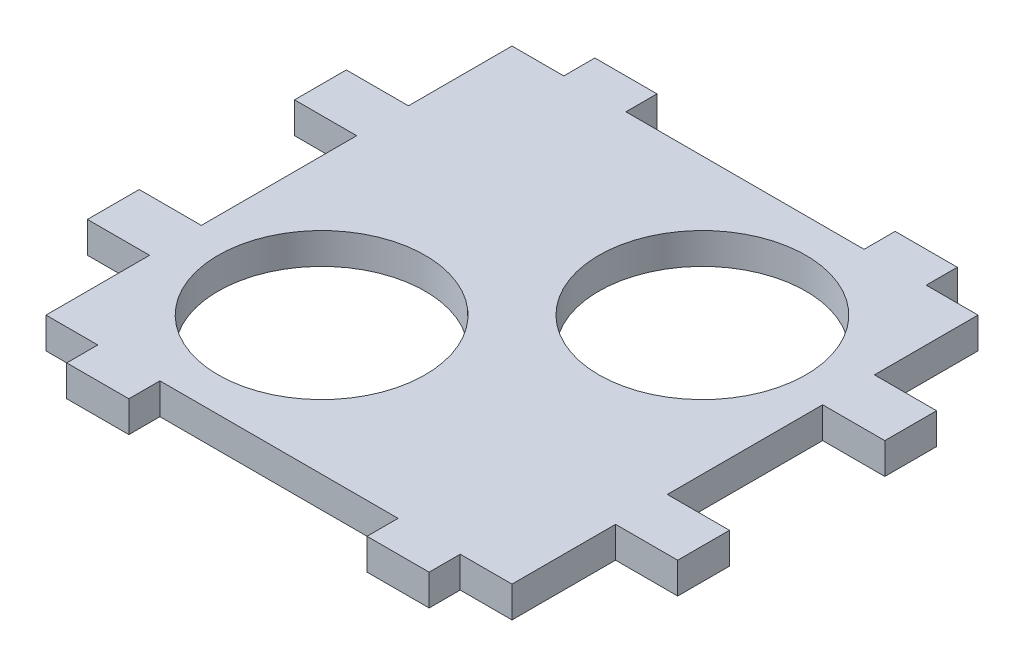
ISO-10303-21;
HEADER;
FILE_DESCRIPTION(('STEP AP214'),'2;1');
FILE_NAME('part.step','',(''),(''),'','','');
FILE_SCHEMA(('AUTOMOTIVE_DESIGN { 1 0 10303 214 1 1 1 1 }'));
ENDSEC;
DATA;
#1=APPLICATION_CONTEXT('core data for automotive mechanical design processes');
#2=APPLICATION_PROTOCOL_DEFINITION('international standard','automotive_design',2000,#1);
#3=PRODUCT_CONTEXT('',#1,'mechanical');
#4=PRODUCT('Part','Part','',(#3));
#5=PRODUCT_RELATED_PRODUCT_CATEGORY('part','',(#4));
#6=PRODUCT_DEFINITION_FORMATION('','',#4);
#7=PRODUCT_DEFINITION_CONTEXT('part definition',#1,'design');
#8=PRODUCT_DEFINITION('design','',#6,#7);
#9=PRODUCT_DEFINITION_SHAPE('','',#8);
#10=(LENGTH_UNIT() NAMED_UNIT(*) SI_UNIT(.MILLI.,.METRE.));
#11=(NAMED_UNIT(*) PLANE_ANGLE_UNIT() SI_UNIT($,.RADIAN.));
#12=(NAMED_UNIT(*) SI_UNIT($,.STERADIAN.) SOLID_ANGLE_UNIT());
#13=UNCERTAINTY_MEASURE_WITH_UNIT(LENGTH_MEASURE(1.E-05),#10,'distance_accuracy_value','');
#14=(GEOMETRIC_REPRESENTATION_CONTEXT(3) GLOBAL_UNCERTAINTY_ASSIGNED_CONTEXT((#13)) GLOBAL_UNIT_ASSIGNED_CONTEXT((#10,
#11,#12)) REPRESENTATION_CONTEXT('',''));
#15=CARTESIAN_POINT('',(0.,0.,0.));
#16=DIRECTION('',(0.,0.,1.));
#17=DIRECTION('',(1.,0.,0.));
#18=AXIS2_PLACEMENT_3D('',#15,#16,#17);
#19=CARTESIAN_POINT('',(22.5,3.,0.));
#20=DIRECTION('',(1.,0.,0.));
#21=DIRECTION('',(0.,0.,-1.));
#22=AXIS2_PLACEMENT_3D('',#19,#20,#21);
#23=PLANE('',#22);
#24=DIRECTION('',(0.,0.,1.));
#25=VECTOR('',#24,1.);
#26=CARTESIAN_POINT('',(22.5,0.,0.));
#27=LINE('',#26,#25);
#28=CARTESIAN_POINT('',(22.5,0.,-7.50000000000001));
#29=VERTEX_POINT('',#28);
#30=CARTESIAN_POINT('',(22.5,0.,7.49999999999998));
#31=VERTEX_POINT('',#30);
#32=EDGE_CURVE('E505',#29,#31,#27,.T.);
#33=ORIENTED_EDGE('',*,*,#32,.F.);
#34=DIRECTION('',(0.,-1.,0.));
#35=VECTOR('',#34,1.);
#36=CARTESIAN_POINT('',(22.5,3.,-7.50000000000001));
#37=LINE('',#36,#35);
#38=CARTESIAN_POINT('',(22.5,3.,-7.50000000000001));
#39=VERTEX_POINT('',#38);
#40=EDGE_CURVE('E303',#39,#29,#37,.T.);
#41=ORIENTED_EDGE('',*,*,#40,.F.);
#42=DIRECTION('',(0.,0.,1.));
#43=VECTOR('',#42,1.);
#44=CARTESIAN_POINT('',(22.5,3.,0.));
#45=LINE('',#44,#43);
#46=CARTESIAN_POINT('',(22.5,3.,7.49999999999998));
#47=VERTEX_POINT('',#46);
#48=EDGE_CURVE('E38',#39,#47,#45,.T.);
#49=ORIENTED_EDGE('',*,*,#48,.T.);
#50=DIRECTION('',(0.,-1.,0.));
#51=VECTOR('',#50,1.);
#52=CARTESIAN_POINT('',(22.5,3.,7.49999999999998));
#53=LINE('',#52,#51);
#54=EDGE_CURVE('E408',#47,#31,#53,.T.);
#55=ORIENTED_EDGE('',*,*,#54,.T.);
#56=EDGE_LOOP('',(#33,#41,#49,#55));
#57=FACE_BOUND('',#56,.T.);
#58=ADVANCED_FACE('F34',(#57),#23,.T.);
#59=CARTESIAN_POINT('',(-22.5,3.,0.));
#60=DIRECTION('',(1.,0.,0.));
#61=DIRECTION('',(0.,0.,-1.));
#62=AXIS2_PLACEMENT_3D('',#59,#60,#61);
#63=PLANE('',#62);
#64=DIRECTION('',(0.,-1.,0.));
#65=VECTOR('',#64,1.);
#66=CARTESIAN_POINT('',(-22.5,3.,-12.5));
#67=LINE('',#66,#65);
#68=CARTESIAN_POINT('',(-22.5,3.,-12.5));
#69=VERTEX_POINT('',#68);
#70=CARTESIAN_POINT('',(-22.5,0.,-12.5));
#71=VERTEX_POINT('',#70);
#72=EDGE_CURVE('E315',#69,#71,#67,.T.);
#73=ORIENTED_EDGE('',*,*,#72,.F.);
#74=DIRECTION('',(0.,0.,1.));
#75=VECTOR('',#74,1.);
#76=CARTESIAN_POINT('',(-22.5,3.,0.));
#77=LINE('',#76,#75);
#78=CARTESIAN_POINT('',(-22.5,3.,-22.5));
#79=VERTEX_POINT('',#78);
#80=EDGE_CURVE('E463',#79,#69,#77,.T.);
#81=ORIENTED_EDGE('',*,*,#80,.F.);
#82=DIRECTION('',(0.,-1.,0.));
#83=VECTOR('',#82,1.);
#84=CARTESIAN_POINT('',(-22.5,3.,-22.5));
#85=LINE('',#84,#83);
#86=CARTESIAN_POINT('',(-22.5,0.,-22.5));
#87=VERTEX_POINT('',#86);
#88=EDGE_CURVE('E522',#79,#87,#85,.T.);
#89=ORIENTED_EDGE('',*,*,#88,.T.);
#90=DIRECTION('',(0.,0.,1.));
#91=VECTOR('',#90,1.);
#92=CARTESIAN_POINT('',(-22.5,0.,0.));
#93=LINE('',#92,#91);
#94=EDGE_CURVE('E376',#87,#71,#93,.T.);
#95=ORIENTED_EDGE('',*,*,#94,.T.);
#96=EDGE_LOOP('',(#73,#81,#89,#95));
#97=FACE_BOUND('',#96,.T.);
#98=ADVANCED_FACE('F638',(#97),#63,.F.);
#99=CARTESIAN_POINT('',(-22.5,3.,-7.50000000000001));
#100=VERTEX_POINT('',#99);
#101=CARTESIAN_POINT('',(-22.5,3.,7.49999999999998));
#102=VERTEX_POINT('',#101);
#103=EDGE_CURVE('E60',#100,#102,#77,.T.);
#104=ORIENTED_EDGE('',*,*,#103,.F.);
#105=DIRECTION('',(0.,-1.,0.));
#106=VECTOR('',#105,1.);
#107=CARTESIAN_POINT('',(-22.5,3.,-7.50000000000001));
#108=LINE('',#107,#106);
#109=CARTESIAN_POINT('',(-22.5,0.,-7.50000000000001));
#110=VERTEX_POINT('',#109);
#111=EDGE_CURVE('E325',#100,#110,#108,.T.);
#112=ORIENTED_EDGE('',*,*,#111,.T.);
#113=CARTESIAN_POINT('',(-22.5,0.,7.49999999999998));
#114=VERTEX_POINT('',#113);
#115=EDGE_CURVE('E373',#110,#114,#93,.T.);
#116=ORIENTED_EDGE('',*,*,#115,.T.);
#117=DIRECTION('',(0.,-1.,0.));
#118=VECTOR('',#117,1.);
#119=CARTESIAN_POINT('',(-22.5,3.,7.49999999999998));
#120=LINE('',#119,#118);
#121=EDGE_CURVE('E354',#102,#114,#120,.T.);
#122=ORIENTED_EDGE('',*,*,#121,.F.);
#123=EDGE_LOOP('',(#104,#112,#116,#122));
#124=FACE_BOUND('',#123,.T.);
#125=ADVANCED_FACE('F652',(#124),#63,.F.);
#126=DIRECTION('',(0.,-1.,0.));
#127=VECTOR('',#126,1.);
#128=CARTESIAN_POINT('',(22.5,3.,-12.5));
#129=LINE('',#128,#127);
#130=CARTESIAN_POINT('',(22.5,3.,-12.5));
#131=VERTEX_POINT('',#130);
#132=CARTESIAN_POINT('',(22.5,0.,-12.5));
#133=VERTEX_POINT('',#132);
#134=EDGE_CURVE('E280',#131,#133,#129,.T.);
#135=ORIENTED_EDGE('',*,*,#134,.T.);
#136=CARTESIAN_POINT('',(22.5,0.,-22.5));
#137=VERTEX_POINT('',#136);
#138=EDGE_CURVE('E503',#137,#133,#27,.T.);
#139=ORIENTED_EDGE('',*,*,#138,.F.);
#140=DIRECTION('',(0.,-1.,0.));
#141=VECTOR('',#140,1.);
#142=CARTESIAN_POINT('',(22.5,3.,-22.5));
#143=LINE('',#142,#141);
#144=CARTESIAN_POINT('',(22.5,3.,-22.5));
#145=VERTEX_POINT('',#144);
#146=EDGE_CURVE('E11',#145,#137,#143,.T.);
#147=ORIENTED_EDGE('',*,*,#146,.F.);
#148=EDGE_CURVE('E603',#145,#131,#45,.T.);
#149=ORIENTED_EDGE('',*,*,#148,.T.);
#150=EDGE_LOOP('',(#135,#139,#147,#149));
#151=FACE_BOUND('',#150,.T.);
#152=ADVANCED_FACE('F670',(#151),#23,.T.);
#153=DIRECTION('',(0.,-1.,0.));
#154=VECTOR('',#153,1.);
#155=CARTESIAN_POINT('',(22.5,3.,12.5));
#156=LINE('',#155,#154);
#157=CARTESIAN_POINT('',(22.5,3.,12.5));
#158=VERTEX_POINT('',#157);
#159=CARTESIAN_POINT('',(22.5,0.,12.5));
#160=VERTEX_POINT('',#159);
#161=EDGE_CURVE('E405',#158,#160,#156,.T.);
#162=ORIENTED_EDGE('',*,*,#161,.F.);
#163=CARTESIAN_POINT('',(22.5,3.,22.5));
#164=VERTEX_POINT('',#163);
#165=EDGE_CURVE('E571',#158,#164,#45,.T.);
#166=ORIENTED_EDGE('',*,*,#165,.T.);
#167=DIRECTION('',(0.,-1.,0.));
#168=VECTOR('',#167,1.);
#169=CARTESIAN_POINT('',(22.5,3.,22.5));
#170=LINE('',#169,#168);
#171=CARTESIAN_POINT('',(22.5,0.,22.5));
#172=VERTEX_POINT('',#171);
#173=EDGE_CURVE('E545',#164,#172,#170,.T.);
#174=ORIENTED_EDGE('',*,*,#173,.T.);
#175=EDGE_CURVE('E500',#160,#172,#27,.T.);
#176=ORIENTED_EDGE('',*,*,#175,.F.);
#177=EDGE_LOOP('',(#162,#166,#174,#176));
#178=FACE_BOUND('',#177,.T.);
#179=ADVANCED_FACE('F36',(#178),#23,.T.);
#180=CARTESIAN_POINT('',(0.,3.,-22.5));
#181=DIRECTION('',(0.,0.,-1.));
#182=DIRECTION('',(-1.,0.,0.));
#183=AXIS2_PLACEMENT_3D('',#180,#181,#182);
#184=PLANE('',#183);
#185=DIRECTION('',(1.,0.,0.));
#186=VECTOR('',#185,1.);
#187=CARTESIAN_POINT('',(0.,0.,-22.5));
#188=LINE('',#187,#186);
#189=CARTESIAN_POINT('',(17.5,0.,-22.5));
#190=VERTEX_POINT('',#189);
#191=EDGE_CURVE('E495',#190,#137,#188,.T.);
#192=ORIENTED_EDGE('',*,*,#191,.F.);
#193=DIRECTION('',(0.,-1.,0.));
#194=VECTOR('',#193,1.);
#195=CARTESIAN_POINT('',(17.5,3.,-22.5));
#196=LINE('',#195,#194);
#197=CARTESIAN_POINT('',(17.5,3.,-22.5));
#198=VERTEX_POINT('',#197);
#199=EDGE_CURVE('E44',#198,#190,#196,.T.);
#200=ORIENTED_EDGE('',*,*,#199,.F.);
#201=DIRECTION('',(1.,0.,0.));
#202=VECTOR('',#201,1.);
#203=CARTESIAN_POINT('',(0.,3.,-22.5));
#204=LINE('',#203,#202);
#205=EDGE_CURVE('E468',#198,#145,#204,.T.);
#206=ORIENTED_EDGE('',*,*,#205,.T.);
#207=ORIENTED_EDGE('',*,*,#146,.T.);
#208=EDGE_LOOP('',(#192,#200,#206,#207));
#209=FACE_BOUND('',#208,.T.);
#210=ADVANCED_FACE('F679',(#209),#184,.T.);
#211=CARTESIAN_POINT('',(17.5,3.,0.));
#212=DIRECTION('',(-1.,0.,0.));
#213=DIRECTION('',(0.,0.,1.));
#214=AXIS2_PLACEMENT_3D('',#211,#212,#213);
#215=PLANE('',#214);
#216=DIRECTION('',(0.,0.,-1.));
#217=VECTOR('',#216,1.);
#218=CARTESIAN_POINT('',(17.5,0.,0.));
#219=LINE('',#218,#217);
#220=CARTESIAN_POINT('',(17.5,0.,-25.5));
#221=VERTEX_POINT('',#220);
#222=EDGE_CURVE('E729',#190,#221,#219,.T.);
#223=ORIENTED_EDGE('',*,*,#222,.T.);
#224=DIRECTION('',(0.,-1.,0.));
#225=VECTOR('',#224,1.);
#226=CARTESIAN_POINT('',(17.5,3.,-25.5));
#227=LINE('',#226,#225);
#228=CARTESIAN_POINT('',(17.5,3.,-25.5));
#229=VERTEX_POINT('',#228);
#230=EDGE_CURVE('E508',#229,#221,#227,.T.);
#231=ORIENTED_EDGE('',*,*,#230,.F.);
#232=DIRECTION('',(0.,0.,-1.));
#233=VECTOR('',#232,1.);
#234=CARTESIAN_POINT('',(17.5,3.,0.));
#235=LINE('',#234,#233);
#236=EDGE_CURVE('E609',#198,#229,#235,.T.);
#237=ORIENTED_EDGE('',*,*,#236,.F.);
#238=ORIENTED_EDGE('',*,*,#199,.T.);
#239=EDGE_LOOP('',(#223,#231,#237,#238));
#240=FACE_BOUND('',#239,.T.);
#241=ADVANCED_FACE('F683',(#240),#215,.F.);
#242=CARTESIAN_POINT('',(0.,3.,-25.5));
#243=DIRECTION('',(0.,0.,-1.));
#244=DIRECTION('',(-1.,0.,0.));
#245=AXIS2_PLACEMENT_3D('',#242,#243,#244);
#246=PLANE('',#245);
#247=DIRECTION('',(1.,0.,0.));
#248=VECTOR('',#247,1.);
#249=CARTESIAN_POINT('',(0.,0.,-25.5));
#250=LINE('',#249,#248);
#251=CARTESIAN_POINT('',(11.5,0.,-25.5));
#252=VERTEX_POINT('',#251);
#253=EDGE_CURVE('E722',#252,#221,#250,.T.);
#254=ORIENTED_EDGE('',*,*,#253,.F.);
#255=DIRECTION('',(0.,-1.,0.));
#256=VECTOR('',#255,1.);
#257=CARTESIAN_POINT('',(11.5,3.,-25.5));
#258=LINE('',#257,#256);
#259=CARTESIAN_POINT('',(11.5,3.,-25.5));
#260=VERTEX_POINT('',#259);
#261=EDGE_CURVE('E510',#260,#252,#258,.T.);
#262=ORIENTED_EDGE('',*,*,#261,.F.);
#263=DIRECTION('',(1.,0.,0.));
#264=VECTOR('',#263,1.);
#265=CARTESIAN_POINT('',(0.,3.,-25.5));
#266=LINE('',#265,#264);
#267=EDGE_CURVE('E611',#260,#229,#266,.T.);
#268=ORIENTED_EDGE('',*,*,#267,.T.);
#269=ORIENTED_EDGE('',*,*,#230,.T.);
#270=EDGE_LOOP('',(#254,#262,#268,#269));
#271=FACE_BOUND('',#270,.T.);
#272=ADVANCED_FACE('F690',(#271),#246,.T.);
#273=CARTESIAN_POINT('',(11.5,3.,0.));
#274=DIRECTION('',(-1.,0.,0.));
#275=DIRECTION('',(0.,0.,1.));
#276=AXIS2_PLACEMENT_3D('',#273,#274,#275);
#277=PLANE('',#276);
#278=DIRECTION('',(0.,0.,-1.));
#279=VECTOR('',#278,1.);
#280=CARTESIAN_POINT('',(11.5,0.,0.));
#281=LINE('',#280,#279);
#282=CARTESIAN_POINT('',(11.5,0.,-22.5));
#283=VERTEX_POINT('',#282);
#284=EDGE_CURVE('E728',#283,#252,#281,.T.);
#285=ORIENTED_EDGE('',*,*,#284,.F.);
#286=DIRECTION('',(0.,-1.,0.));
#287=VECTOR('',#286,1.);
#288=CARTESIAN_POINT('',(11.5,3.,-22.5));
#289=LINE('',#288,#287);
#290=CARTESIAN_POINT('',(11.5,3.,-22.5));
#291=VERTEX_POINT('',#290);
#292=EDGE_CURVE('E512',#291,#283,#289,.T.);
#293=ORIENTED_EDGE('',*,*,#292,.F.);
#294=DIRECTION('',(0.,0.,-1.));
#295=VECTOR('',#294,1.);
#296=CARTESIAN_POINT('',(11.5,3.,0.));
#297=LINE('',#296,#295);
#298=EDGE_CURVE('E614',#291,#260,#297,.T.);
#299=ORIENTED_EDGE('',*,*,#298,.T.);
#300=ORIENTED_EDGE('',*,*,#261,.T.);
#301=EDGE_LOOP('',(#285,#293,#299,#300));
#302=FACE_BOUND('',#301,.T.);
#303=ADVANCED_FACE('F696',(#302),#277,.T.);
#304=CARTESIAN_POINT('',(-11.5,0.,-22.5));
#305=VERTEX_POINT('',#304);
#306=EDGE_CURVE('E735',#305,#283,#188,.T.);
#307=ORIENTED_EDGE('',*,*,#306,.F.);
#308=DIRECTION('',(0.,-1.,0.));
#309=VECTOR('',#308,1.);
#310=CARTESIAN_POINT('',(-11.5,3.,-22.5));
#311=LINE('',#310,#309);
#312=CARTESIAN_POINT('',(-11.5,3.,-22.5));
#313=VERTEX_POINT('',#312);
#314=EDGE_CURVE('E514',#313,#305,#311,.T.);
#315=ORIENTED_EDGE('',*,*,#314,.F.);
#316=EDGE_CURVE('E467',#313,#291,#204,.T.);
#317=ORIENTED_EDGE('',*,*,#316,.T.);
#318=ORIENTED_EDGE('',*,*,#292,.T.);
#319=EDGE_LOOP('',(#307,#315,#317,#318));
#320=FACE_BOUND('',#319,.T.);
#321=ADVANCED_FACE('F686',(#320),#184,.T.);
#322=CARTESIAN_POINT('',(-11.5,3.,0.));
#323=DIRECTION('',(-1.,0.,0.));
#324=DIRECTION('',(0.,0.,1.));
#325=AXIS2_PLACEMENT_3D('',#322,#323,#324);
#326=PLANE('',#325);
#327=DIRECTION('',(0.,0.,-1.));
#328=VECTOR('',#327,1.);
#329=CARTESIAN_POINT('',(-11.5,0.,0.));
#330=LINE('',#329,#328);
#331=CARTESIAN_POINT('',(-11.5,0.,-25.5));
#332=VERTEX_POINT('',#331);
#333=EDGE_CURVE('E737',#305,#332,#330,.T.);
#334=ORIENTED_EDGE('',*,*,#333,.T.);
#335=DIRECTION('',(0.,-1.,0.));
#336=VECTOR('',#335,1.);
#337=CARTESIAN_POINT('',(-11.5,3.,-25.5));
#338=LINE('',#337,#336);
#339=CARTESIAN_POINT('',(-11.5,3.,-25.5));
#340=VERTEX_POINT('',#339);
#341=EDGE_CURVE('E516',#340,#332,#338,.T.);
#342=ORIENTED_EDGE('',*,*,#341,.F.);
#343=DIRECTION('',(0.,0.,-1.));
#344=VECTOR('',#343,1.);
#345=CARTESIAN_POINT('',(-11.5,3.,0.));
#346=LINE('',#345,#344);
#347=EDGE_CURVE('E617',#313,#340,#346,.T.);
#348=ORIENTED_EDGE('',*,*,#347,.F.);
#349=ORIENTED_EDGE('',*,*,#314,.T.);
#350=EDGE_LOOP('',(#334,#342,#348,#349));
#351=FACE_BOUND('',#350,.T.);
#352=ADVANCED_FACE('F695',(#351),#326,.F.);
#353=CARTESIAN_POINT('',(0.,3.,-25.5));
#354=DIRECTION('',(0.,0.,-1.));
#355=DIRECTION('',(-1.,0.,0.));
#356=AXIS2_PLACEMENT_3D('',#353,#354,#355);
#357=PLANE('',#356);
#358=DIRECTION('',(1.,0.,0.));
#359=VECTOR('',#358,1.);
#360=CARTESIAN_POINT('',(0.,0.,-25.5));
#361=LINE('',#360,#359);
#362=CARTESIAN_POINT('',(-17.5,0.,-25.5));
#363=VERTEX_POINT('',#362);
#364=EDGE_CURVE('E740',#363,#332,#361,.T.);
#365=ORIENTED_EDGE('',*,*,#364,.F.);
#366=DIRECTION('',(0.,-1.,0.));
#367=VECTOR('',#366,1.);
#368=CARTESIAN_POINT('',(-17.5,3.,-25.5));
#369=LINE('',#368,#367);
#370=CARTESIAN_POINT('',(-17.5,3.,-25.5));
#371=VERTEX_POINT('',#370);
#372=EDGE_CURVE('E518',#371,#363,#369,.T.);
#373=ORIENTED_EDGE('',*,*,#372,.F.);
#374=DIRECTION('',(1.,0.,0.));
#375=VECTOR('',#374,1.);
#376=CARTESIAN_POINT('',(0.,3.,-25.5));
#377=LINE('',#376,#375);
#378=EDGE_CURVE('E618',#371,#340,#377,.T.);
#379=ORIENTED_EDGE('',*,*,#378,.T.);
#380=ORIENTED_EDGE('',*,*,#341,.T.);
#381=EDGE_LOOP('',(#365,#373,#379,#380));
#382=FACE_BOUND('',#381,.T.);
#383=ADVANCED_FACE('F704',(#382),#357,.T.);
#384=CARTESIAN_POINT('',(-17.5,3.,0.));
#385=DIRECTION('',(-1.,0.,0.));
#386=DIRECTION('',(0.,0.,1.));
#387=AXIS2_PLACEMENT_3D('',#384,#385,#386);
#388=PLANE('',#387);
#389=DIRECTION('',(0.,0.,-1.));
#390=VECTOR('',#389,1.);
#391=CARTESIAN_POINT('',(-17.5,0.,0.));
#392=LINE('',#391,#390);
#393=CARTESIAN_POINT('',(-17.5,0.,-22.5));
#394=VERTEX_POINT('',#393);
#395=EDGE_CURVE('E382',#394,#363,#392,.T.);
#396=ORIENTED_EDGE('',*,*,#395,.F.);
#397=DIRECTION('',(0.,-1.,0.));
#398=VECTOR('',#397,1.);
#399=CARTESIAN_POINT('',(-17.5,3.,-22.5));
#400=LINE('',#399,#398);
#401=CARTESIAN_POINT('',(-17.5,3.,-22.5));
#402=VERTEX_POINT('',#401);
#403=EDGE_CURVE('E520',#402,#394,#400,.T.);
#404=ORIENTED_EDGE('',*,*,#403,.F.);
#405=DIRECTION('',(0.,0.,-1.));
#406=VECTOR('',#405,1.);
#407=CARTESIAN_POINT('',(-17.5,3.,0.));
#408=LINE('',#407,#406);
#409=EDGE_CURVE('E465',#402,#371,#408,.T.);
#410=ORIENTED_EDGE('',*,*,#409,.T.);
#411=ORIENTED_EDGE('',*,*,#372,.T.);
#412=EDGE_LOOP('',(#396,#404,#410,#411));
#413=FACE_BOUND('',#412,.T.);
#414=ADVANCED_FACE('F626',(#413),#388,.T.);
#415=EDGE_CURVE('E635',#87,#394,#188,.T.);
#416=ORIENTED_EDGE('',*,*,#415,.F.);
#417=ORIENTED_EDGE('',*,*,#88,.F.);
#418=EDGE_CURVE('E461',#79,#402,#204,.T.);
#419=ORIENTED_EDGE('',*,*,#418,.T.);
#420=ORIENTED_EDGE('',*,*,#403,.T.);
#421=EDGE_LOOP('',(#416,#417,#419,#420));
#422=FACE_BOUND('',#421,.T.);
#423=ADVANCED_FACE('F632',(#422),#184,.T.);
#424=CARTESIAN_POINT('',(-22.5,3.,12.5));
#425=VERTEX_POINT('',#424);
#426=CARTESIAN_POINT('',(-22.5,3.,22.5));
#427=VERTEX_POINT('',#426);
#428=EDGE_CURVE('E455',#425,#427,#77,.T.);
#429=ORIENTED_EDGE('',*,*,#428,.F.);
#430=DIRECTION('',(0.,-1.,0.));
#431=VECTOR('',#430,1.);
#432=CARTESIAN_POINT('',(-22.5,3.,12.5));
#433=LINE('',#432,#431);
#434=CARTESIAN_POINT('',(-22.5,0.,12.5));
#435=VERTEX_POINT('',#434);
#436=EDGE_CURVE('E358',#425,#435,#433,.T.);
#437=ORIENTED_EDGE('',*,*,#436,.T.);
#438=CARTESIAN_POINT('',(-22.5,0.,22.5));
#439=VERTEX_POINT('',#438);
#440=EDGE_CURVE('E377',#435,#439,#93,.T.);
#441=ORIENTED_EDGE('',*,*,#440,.T.);
#442=DIRECTION('',(0.,-1.,0.));
#443=VECTOR('',#442,1.);
#444=CARTESIAN_POINT('',(-22.5,3.,22.5));
#445=LINE('',#444,#443);
#446=EDGE_CURVE('E459',#427,#439,#445,.T.);
#447=ORIENTED_EDGE('',*,*,#446,.F.);
#448=EDGE_LOOP('',(#429,#437,#441,#447));
#449=FACE_BOUND('',#448,.T.);
#450=ADVANCED_FACE('F457',(#449),#63,.F.);
#451=CARTESIAN_POINT('',(0.,3.,22.5));
#452=DIRECTION('',(0.,0.,-1.));
#453=DIRECTION('',(-1.,0.,0.));
#454=AXIS2_PLACEMENT_3D('',#451,#452,#453);
#455=PLANE('',#454);
#456=DIRECTION('',(1.,0.,0.));
#457=VECTOR('',#456,1.);
#458=CARTESIAN_POINT('',(0.,0.,22.5));
#459=LINE('',#458,#457);
#460=CARTESIAN_POINT('',(-17.5,0.,22.5));
#461=VERTEX_POINT('',#460);
#462=EDGE_CURVE('E384',#439,#461,#459,.T.);
#463=ORIENTED_EDGE('',*,*,#462,.T.);
#464=DIRECTION('',(0.,-1.,0.));
#465=VECTOR('',#464,1.);
#466=CARTESIAN_POINT('',(-17.5,3.,22.5));
#467=LINE('',#466,#465);
#468=CARTESIAN_POINT('',(-17.5,3.,22.5));
#469=VERTEX_POINT('',#468);
#470=EDGE_CURVE('E525',#469,#461,#467,.T.);
#471=ORIENTED_EDGE('',*,*,#470,.F.);
#472=DIRECTION('',(1.,0.,0.));
#473=VECTOR('',#472,1.);
#474=CARTESIAN_POINT('',(0.,3.,22.5));
#475=LINE('',#474,#473);
#476=EDGE_CURVE('E473',#427,#469,#475,.T.);
#477=ORIENTED_EDGE('',*,*,#476,.F.);
#478=ORIENTED_EDGE('',*,*,#446,.T.);
#479=EDGE_LOOP('',(#463,#471,#477,#478));
#480=FACE_BOUND('',#479,.T.);
#481=ADVANCED_FACE('F703',(#480),#455,.F.);
#482=CARTESIAN_POINT('',(-17.5,3.,0.));
#483=DIRECTION('',(1.,0.,0.));
#484=DIRECTION('',(0.,0.,-1.));
#485=AXIS2_PLACEMENT_3D('',#482,#483,#484);
#486=PLANE('',#485);
#487=DIRECTION('',(0.,0.,1.));
#488=VECTOR('',#487,1.);
#489=CARTESIAN_POINT('',(-17.5,0.,0.));
#490=LINE('',#489,#488);
#491=CARTESIAN_POINT('',(-17.5,0.,25.5));
#492=VERTEX_POINT('',#491);
#493=EDGE_CURVE('E563',#461,#492,#490,.T.);
#494=ORIENTED_EDGE('',*,*,#493,.T.);
#495=DIRECTION('',(0.,-1.,0.));
#496=VECTOR('',#495,1.);
#497=CARTESIAN_POINT('',(-17.5,3.,25.5));
#498=LINE('',#497,#496);
#499=CARTESIAN_POINT('',(-17.5,3.,25.5));
#500=VERTEX_POINT('',#499);
#501=EDGE_CURVE('E528',#500,#492,#498,.T.);
#502=ORIENTED_EDGE('',*,*,#501,.F.);
#503=DIRECTION('',(0.,0.,1.));
#504=VECTOR('',#503,1.);
#505=CARTESIAN_POINT('',(-17.5,3.,0.));
#506=LINE('',#505,#504);
#507=EDGE_CURVE('E477',#469,#500,#506,.T.);
#508=ORIENTED_EDGE('',*,*,#507,.F.);
#509=ORIENTED_EDGE('',*,*,#470,.T.);
#510=EDGE_LOOP('',(#494,#502,#508,#509));
#511=FACE_BOUND('',#510,.T.);
#512=ADVANCED_FACE('F758',(#511),#486,.F.);
#513=CARTESIAN_POINT('',(0.,3.,25.5));
#514=DIRECTION('',(0.,0.,-1.));
#515=DIRECTION('',(-1.,0.,0.));
#516=AXIS2_PLACEMENT_3D('',#513,#514,#515);
#517=PLANE('',#516);
#518=DIRECTION('',(1.,0.,0.));
#519=VECTOR('',#518,1.);
#520=CARTESIAN_POINT('',(0.,0.,25.5));
#521=LINE('',#520,#519);
#522=CARTESIAN_POINT('',(-11.5,0.,25.5));
#523=VERTEX_POINT('',#522);
#524=EDGE_CURVE('E561',#492,#523,#521,.T.);
#525=ORIENTED_EDGE('',*,*,#524,.T.);
#526=DIRECTION('',(0.,-1.,0.));
#527=VECTOR('',#526,1.);
#528=CARTESIAN_POINT('',(-11.5,3.,25.5));
#529=LINE('',#528,#527);
#530=CARTESIAN_POINT('',(-11.5,3.,25.5));
#531=VERTEX_POINT('',#530);
#532=EDGE_CURVE('E531',#531,#523,#529,.T.);
#533=ORIENTED_EDGE('',*,*,#532,.F.);
#534=DIRECTION('',(1.,0.,0.));
#535=VECTOR('',#534,1.);
#536=CARTESIAN_POINT('',(0.,3.,25.5));
#537=LINE('',#536,#535);
#538=EDGE_CURVE('E481',#500,#531,#537,.T.);
#539=ORIENTED_EDGE('',*,*,#538,.F.);
#540=ORIENTED_EDGE('',*,*,#501,.T.);
#541=EDGE_LOOP('',(#525,#533,#539,#540));
#542=FACE_BOUND('',#541,.T.);
#543=ADVANCED_FACE('F755',(#542),#517,.F.);
#544=CARTESIAN_POINT('',(-11.5,3.,0.));
#545=DIRECTION('',(1.,0.,0.));
#546=DIRECTION('',(0.,0.,-1.));
#547=AXIS2_PLACEMENT_3D('',#544,#545,#546);
#548=PLANE('',#547);
#549=DIRECTION('',(0.,0.,1.));
#550=VECTOR('',#549,1.);
#551=CARTESIAN_POINT('',(-11.5,0.,0.));
#552=LINE('',#551,#550);
#553=CARTESIAN_POINT('',(-11.5,0.,22.5));
#554=VERTEX_POINT('',#553);
#555=EDGE_CURVE('E558',#554,#523,#552,.T.);
#556=ORIENTED_EDGE('',*,*,#555,.F.);
#557=DIRECTION('',(0.,-1.,0.));
#558=VECTOR('',#557,1.);
#559=CARTESIAN_POINT('',(-11.5,3.,22.5));
#560=LINE('',#559,#558);
#561=CARTESIAN_POINT('',(-11.5,3.,22.5));
#562=VERTEX_POINT('',#561);
#563=EDGE_CURVE('E533',#562,#554,#560,.T.);
#564=ORIENTED_EDGE('',*,*,#563,.F.);
#565=DIRECTION('',(0.,0.,1.));
#566=VECTOR('',#565,1.);
#567=CARTESIAN_POINT('',(-11.5,3.,0.));
#568=LINE('',#567,#566);
#569=EDGE_CURVE('E483',#562,#531,#568,.T.);
#570=ORIENTED_EDGE('',*,*,#569,.T.);
#571=ORIENTED_EDGE('',*,*,#532,.T.);
#572=EDGE_LOOP('',(#556,#564,#570,#571));
#573=FACE_BOUND('',#572,.T.);
#574=ADVANCED_FACE('F765',(#573),#548,.T.);
#575=CARTESIAN_POINT('',(11.5,0.,22.5));
#576=VERTEX_POINT('',#575);
#577=EDGE_CURVE('E557',#554,#576,#459,.T.);
#578=ORIENTED_EDGE('',*,*,#577,.T.);
#579=DIRECTION('',(0.,-1.,0.));
#580=VECTOR('',#579,1.);
#581=CARTESIAN_POINT('',(11.5,3.,22.5));
#582=LINE('',#581,#580);
#583=CARTESIAN_POINT('',(11.5,3.,22.5));
#584=VERTEX_POINT('',#583);
#585=EDGE_CURVE('E535',#584,#576,#582,.T.);
#586=ORIENTED_EDGE('',*,*,#585,.F.);
#587=EDGE_CURVE('E479',#562,#584,#475,.T.);
#588=ORIENTED_EDGE('',*,*,#587,.F.);
#589=ORIENTED_EDGE('',*,*,#563,.T.);
#590=EDGE_LOOP('',(#578,#586,#588,#589));
#591=FACE_BOUND('',#590,.T.);
#592=ADVANCED_FACE('F575',(#591),#455,.F.);
#593=CARTESIAN_POINT('',(11.5,3.,0.));
#594=DIRECTION('',(1.,0.,0.));
#595=DIRECTION('',(0.,0.,-1.));
#596=AXIS2_PLACEMENT_3D('',#593,#594,#595);
#597=PLANE('',#596);
#598=DIRECTION('',(0.,0.,1.));
#599=VECTOR('',#598,1.);
#600=CARTESIAN_POINT('',(11.5,0.,0.));
#601=LINE('',#600,#599);
#602=CARTESIAN_POINT('',(11.5,0.,25.5));
#603=VERTEX_POINT('',#602);
#604=EDGE_CURVE('E555',#576,#603,#601,.T.);
#605=ORIENTED_EDGE('',*,*,#604,.T.);
#606=DIRECTION('',(0.,-1.,0.));
#607=VECTOR('',#606,1.);
#608=CARTESIAN_POINT('',(11.5,3.,25.5));
#609=LINE('',#608,#607);
#610=CARTESIAN_POINT('',(11.5,3.,25.5));
#611=VERTEX_POINT('',#610);
#612=EDGE_CURVE('E538',#611,#603,#609,.T.);
#613=ORIENTED_EDGE('',*,*,#612,.F.);
#614=DIRECTION('',(0.,0.,1.));
#615=VECTOR('',#614,1.);
#616=CARTESIAN_POINT('',(11.5,3.,0.));
#617=LINE('',#616,#615);
#618=EDGE_CURVE('E486',#584,#611,#617,.T.);
#619=ORIENTED_EDGE('',*,*,#618,.F.);
#620=ORIENTED_EDGE('',*,*,#585,.T.);
#621=EDGE_LOOP('',(#605,#613,#619,#620));
#622=FACE_BOUND('',#621,.T.);
#623=ADVANCED_FACE('F581',(#622),#597,.F.);
#624=CARTESIAN_POINT('',(0.,3.,25.5));
#625=DIRECTION('',(0.,0.,-1.));
#626=DIRECTION('',(-1.,0.,0.));
#627=AXIS2_PLACEMENT_3D('',#624,#625,#626);
#628=PLANE('',#627);
#629=DIRECTION('',(1.,0.,0.));
#630=VECTOR('',#629,1.);
#631=CARTESIAN_POINT('',(0.,0.,25.5));
#632=LINE('',#631,#630);
#633=CARTESIAN_POINT('',(17.5,0.,25.5));
#634=VERTEX_POINT('',#633);
#635=EDGE_CURVE('E552',#603,#634,#632,.T.);
#636=ORIENTED_EDGE('',*,*,#635,.T.);
#637=DIRECTION('',(0.,-1.,0.));
#638=VECTOR('',#637,1.);
#639=CARTESIAN_POINT('',(17.5,3.,25.5));
#640=LINE('',#639,#638);
#641=CARTESIAN_POINT('',(17.5,3.,25.5));
#642=VERTEX_POINT('',#641);
#643=EDGE_CURVE('E541',#642,#634,#640,.T.);
#644=ORIENTED_EDGE('',*,*,#643,.F.);
#645=DIRECTION('',(1.,0.,0.));
#646=VECTOR('',#645,1.);
#647=CARTESIAN_POINT('',(0.,3.,25.5));
#648=LINE('',#647,#646);
#649=EDGE_CURVE('E488',#611,#642,#648,.T.);
#650=ORIENTED_EDGE('',*,*,#649,.F.);
#651=ORIENTED_EDGE('',*,*,#612,.T.);
#652=EDGE_LOOP('',(#636,#644,#650,#651));
#653=FACE_BOUND('',#652,.T.);
#654=ADVANCED_FACE('F589',(#653),#628,.F.);
#655=CARTESIAN_POINT('',(17.5,3.,0.));
#656=DIRECTION('',(1.,0.,0.));
#657=DIRECTION('',(0.,0.,-1.));
#658=AXIS2_PLACEMENT_3D('',#655,#656,#657);
#659=PLANE('',#658);
#660=DIRECTION('',(0.,0.,1.));
#661=VECTOR('',#660,1.);
#662=CARTESIAN_POINT('',(17.5,0.,0.));
#663=LINE('',#662,#661);
#664=CARTESIAN_POINT('',(17.5,0.,22.5));
#665=VERTEX_POINT('',#664);
#666=EDGE_CURVE('E548',#665,#634,#663,.T.);
#667=ORIENTED_EDGE('',*,*,#666,.F.);
#668=DIRECTION('',(0.,-1.,0.));
#669=VECTOR('',#668,1.);
#670=CARTESIAN_POINT('',(17.5,3.,22.5));
#671=LINE('',#670,#669);
#672=CARTESIAN_POINT('',(17.5,3.,22.5));
#673=VERTEX_POINT('',#672);
#674=EDGE_CURVE('E543',#673,#665,#671,.T.);
#675=ORIENTED_EDGE('',*,*,#674,.F.);
#676=DIRECTION('',(0.,0.,1.));
#677=VECTOR('',#676,1.);
#678=CARTESIAN_POINT('',(17.5,3.,0.));
#679=LINE('',#678,#677);
#680=EDGE_CURVE('E490',#673,#642,#679,.T.);
#681=ORIENTED_EDGE('',*,*,#680,.T.);
#682=ORIENTED_EDGE('',*,*,#643,.T.);
#683=EDGE_LOOP('',(#667,#675,#681,#682));
#684=FACE_BOUND('',#683,.T.);
#685=ADVANCED_FACE('F776',(#684),#659,.T.);
#686=EDGE_CURVE('E551',#665,#172,#459,.T.);
#687=ORIENTED_EDGE('',*,*,#686,.T.);
#688=ORIENTED_EDGE('',*,*,#173,.F.);
#689=EDGE_CURVE('E478',#673,#164,#475,.T.);
#690=ORIENTED_EDGE('',*,*,#689,.F.);
#691=ORIENTED_EDGE('',*,*,#674,.T.);
#692=EDGE_LOOP('',(#687,#688,#690,#691));
#693=FACE_BOUND('',#692,.T.);
#694=ADVANCED_FACE('F598',(#693),#455,.F.);
#695=CARTESIAN_POINT('',(0.,3.,0.));
#696=DIRECTION('',(0.,1.,0.));
#697=DIRECTION('',(0.,0.,1.));
#698=AXIS2_PLACEMENT_3D('',#695,#696,#697);
#699=PLANE('',#698);
#700=CARTESIAN_POINT('',(9.19238815542511,3.,-9.19238815542512));
#701=DIRECTION('',(0.,1.,0.));
#702=DIRECTION('',(0.,0.,1.));
#703=AXIS2_PLACEMENT_3D('',#700,#701,#702);
#704=CIRCLE('',#703,9.99999999999999);
#705=CARTESIAN_POINT('',(9.19238815542511,3.,0.807611844574873));
#706=VERTEX_POINT('',#705);
#707=EDGE_CURVE('E332',#706,#706,#704,.T.);
#708=ORIENTED_EDGE('',*,*,#707,.F.);
#709=EDGE_LOOP('',(#708));
#710=FACE_BOUND('',#709,.T.);
#711=CARTESIAN_POINT('',(-9.19238815542512,3.,9.19238815542511));
#712=DIRECTION('',(0.,1.,0.));
#713=DIRECTION('',(0.,0.,1.));
#714=AXIS2_PLACEMENT_3D('',#711,#712,#713);
#715=CIRCLE('',#714,10.);
#716=CARTESIAN_POINT('',(-9.19238815542512,3.,19.1923881554251));
#717=VERTEX_POINT('',#716);
#718=EDGE_CURVE('E336',#717,#717,#715,.T.);
#719=ORIENTED_EDGE('',*,*,#718,.F.);
#720=EDGE_LOOP('',(#719));
#721=FACE_BOUND('',#720,.T.);
#722=ORIENTED_EDGE('',*,*,#148,.F.);
#723=ORIENTED_EDGE('',*,*,#205,.F.);
#724=ORIENTED_EDGE('',*,*,#236,.T.);
#725=ORIENTED_EDGE('',*,*,#267,.F.);
#726=ORIENTED_EDGE('',*,*,#298,.F.);
#727=ORIENTED_EDGE('',*,*,#316,.F.);
#728=ORIENTED_EDGE('',*,*,#347,.T.);
#729=ORIENTED_EDGE('',*,*,#378,.F.);
#730=ORIENTED_EDGE('',*,*,#409,.F.);
#731=ORIENTED_EDGE('',*,*,#418,.F.);
#732=ORIENTED_EDGE('',*,*,#80,.T.);
#733=DIRECTION('',(-1.,0.,0.));
#734=VECTOR('',#733,1.);
#735=CARTESIAN_POINT('',(0.,3.,-12.5));
#736=LINE('',#735,#734);
#737=CARTESIAN_POINT('',(-28.5,3.,-12.5));
#738=VERTEX_POINT('',#737);
#739=EDGE_CURVE('E306',#69,#738,#736,.T.);
#740=ORIENTED_EDGE('',*,*,#739,.T.);
#741=DIRECTION('',(0.,0.,1.));
#742=VECTOR('',#741,1.);
#743=CARTESIAN_POINT('',(-28.5,3.,0.));
#744=LINE('',#743,#742);
#745=CARTESIAN_POINT('',(-28.5,3.,-7.50000000000001));
#746=VERTEX_POINT('',#745);
#747=EDGE_CURVE('E309',#738,#746,#744,.T.);
#748=ORIENTED_EDGE('',*,*,#747,.T.);
#749=DIRECTION('',(-1.,0.,0.));
#750=VECTOR('',#749,1.);
#751=CARTESIAN_POINT('',(0.,3.,-7.50000000000001));
#752=LINE('',#751,#750);
#753=EDGE_CURVE('E312',#100,#746,#752,.T.);
#754=ORIENTED_EDGE('',*,*,#753,.F.);
#755=ORIENTED_EDGE('',*,*,#103,.T.);
#756=DIRECTION('',(-1.,0.,0.));
#757=VECTOR('',#756,1.);
#758=CARTESIAN_POINT('',(0.,3.,7.49999999999998));
#759=LINE('',#758,#757);
#760=CARTESIAN_POINT('',(-28.5,3.,7.49999999999998));
#761=VERTEX_POINT('',#760);
#762=EDGE_CURVE('E343',#102,#761,#759,.T.);
#763=ORIENTED_EDGE('',*,*,#762,.T.);
#764=DIRECTION('',(0.,0.,1.));
#765=VECTOR('',#764,1.);
#766=CARTESIAN_POINT('',(-28.5,3.,0.));
#767=LINE('',#766,#765);
#768=CARTESIAN_POINT('',(-28.5,3.,12.5));
#769=VERTEX_POINT('',#768);
#770=EDGE_CURVE('E340',#761,#769,#767,.T.);
#771=ORIENTED_EDGE('',*,*,#770,.T.);
#772=DIRECTION('',(-1.,0.,0.));
#773=VECTOR('',#772,1.);
#774=CARTESIAN_POINT('',(0.,3.,12.5));
#775=LINE('',#774,#773);
#776=EDGE_CURVE('E342',#425,#769,#775,.T.);
#777=ORIENTED_EDGE('',*,*,#776,.F.);
#778=ORIENTED_EDGE('',*,*,#428,.T.);
#779=ORIENTED_EDGE('',*,*,#476,.T.);
#780=ORIENTED_EDGE('',*,*,#507,.T.);
#781=ORIENTED_EDGE('',*,*,#538,.T.);
#782=ORIENTED_EDGE('',*,*,#569,.F.);
#783=ORIENTED_EDGE('',*,*,#587,.T.);
#784=ORIENTED_EDGE('',*,*,#618,.T.);
#785=ORIENTED_EDGE('',*,*,#649,.T.);
#786=ORIENTED_EDGE('',*,*,#680,.F.);
#787=ORIENTED_EDGE('',*,*,#689,.T.);
#788=ORIENTED_EDGE('',*,*,#165,.F.);
#789=DIRECTION('',(1.,0.,0.));
#790=VECTOR('',#789,1.);
#791=CARTESIAN_POINT('',(0.,3.,12.5));
#792=LINE('',#791,#790);
#793=CARTESIAN_POINT('',(28.5,3.,12.5));
#794=VERTEX_POINT('',#793);
#795=EDGE_CURVE('E401',#158,#794,#792,.T.);
#796=ORIENTED_EDGE('',*,*,#795,.T.);
#797=DIRECTION('',(0.,0.,1.));
#798=VECTOR('',#797,1.);
#799=CARTESIAN_POINT('',(28.5,3.,0.));
#800=LINE('',#799,#798);
#801=CARTESIAN_POINT('',(28.5,3.,7.49999999999998));
#802=VERTEX_POINT('',#801);
#803=EDGE_CURVE('E397',#802,#794,#800,.T.);
#804=ORIENTED_EDGE('',*,*,#803,.F.);
#805=DIRECTION('',(1.,0.,0.));
#806=VECTOR('',#805,1.);
#807=CARTESIAN_POINT('',(0.,3.,7.49999999999998));
#808=LINE('',#807,#806);
#809=EDGE_CURVE('E404',#47,#802,#808,.T.);
#810=ORIENTED_EDGE('',*,*,#809,.F.);
#811=ORIENTED_EDGE('',*,*,#48,.F.);
#812=DIRECTION('',(1.,0.,0.));
#813=VECTOR('',#812,1.);
#814=CARTESIAN_POINT('',(0.,3.,-7.50000000000001));
#815=LINE('',#814,#813);
#816=CARTESIAN_POINT('',(28.5,3.,-7.50000000000001));
#817=VERTEX_POINT('',#816);
#818=EDGE_CURVE('E289',#39,#817,#815,.T.);
#819=ORIENTED_EDGE('',*,*,#818,.T.);
#820=DIRECTION('',(0.,0.,1.));
#821=VECTOR('',#820,1.);
#822=CARTESIAN_POINT('',(28.5,3.,0.));
#823=LINE('',#822,#821);
#824=CARTESIAN_POINT('',(28.5,3.,-12.5));
#825=VERTEX_POINT('',#824);
#826=EDGE_CURVE('E274',#825,#817,#823,.T.);
#827=ORIENTED_EDGE('',*,*,#826,.F.);
#828=DIRECTION('',(1.,0.,0.));
#829=VECTOR('',#828,1.);
#830=CARTESIAN_POINT('',(0.,3.,-12.5));
#831=LINE('',#830,#829);
#832=EDGE_CURVE('E286',#131,#825,#831,.T.);
#833=ORIENTED_EDGE('',*,*,#832,.F.);
#834=EDGE_LOOP('',(#722,#723,#724,#725,#726,#727,#728,#729,#730,#731,#732,#740,#748,#754,#755,
#763,#771,#777,#778,#779,#780,#781,#782,#783,#784,#785,#786,#787,#788,#796,#804,#810,#811,#819,
#827,#833));
#835=FACE_BOUND('',#834,.T.);
#836=ADVANCED_FACE('F285',(#710,#721,#835),#699,.T.);
#837=CARTESIAN_POINT('',(0.,0.,0.));
#838=DIRECTION('',(0.,1.,0.));
#839=DIRECTION('',(0.,0.,1.));
#840=AXIS2_PLACEMENT_3D('',#837,#838,#839);
#841=PLANE('',#840);
#842=CARTESIAN_POINT('',(9.19238815542511,0.,-9.19238815542512));
#843=DIRECTION('',(0.,1.,0.));
#844=DIRECTION('',(0.,0.,1.));
#845=AXIS2_PLACEMENT_3D('',#842,#843,#844);
#846=CIRCLE('',#845,9.99999999999999);
#847=CARTESIAN_POINT('',(9.19238815542511,0.,0.807611844574873));
#848=VERTEX_POINT('',#847);
#849=EDGE_CURVE('E335',#848,#848,#846,.T.);
#850=ORIENTED_EDGE('',*,*,#849,.T.);
#851=EDGE_LOOP('',(#850));
#852=FACE_BOUND('',#851,.T.);
#853=CARTESIAN_POINT('',(-9.19238815542512,0.,9.19238815542511));
#854=DIRECTION('',(0.,1.,0.));
#855=DIRECTION('',(0.,0.,1.));
#856=AXIS2_PLACEMENT_3D('',#853,#854,#855);
#857=CIRCLE('',#856,10.);
#858=CARTESIAN_POINT('',(-9.19238815542512,0.,19.1923881554251));
#859=VERTEX_POINT('',#858);
#860=EDGE_CURVE('E339',#859,#859,#857,.T.);
#861=ORIENTED_EDGE('',*,*,#860,.T.);
#862=EDGE_LOOP('',(#861));
#863=FACE_BOUND('',#862,.T.);
#864=ORIENTED_EDGE('',*,*,#138,.T.);
#865=DIRECTION('',(1.,0.,0.));
#866=VECTOR('',#865,1.);
#867=CARTESIAN_POINT('',(0.,0.,-12.5));
#868=LINE('',#867,#866);
#869=CARTESIAN_POINT('',(28.5,0.,-12.5));
#870=VERTEX_POINT('',#869);
#871=EDGE_CURVE('E299',#133,#870,#868,.T.);
#872=ORIENTED_EDGE('',*,*,#871,.T.);
#873=DIRECTION('',(0.,0.,1.));
#874=VECTOR('',#873,1.);
#875=CARTESIAN_POINT('',(28.5,0.,0.));
#876=LINE('',#875,#874);
#877=CARTESIAN_POINT('',(28.5,0.,-7.50000000000001));
#878=VERTEX_POINT('',#877);
#879=EDGE_CURVE('E275',#870,#878,#876,.T.);
#880=ORIENTED_EDGE('',*,*,#879,.T.);
#881=DIRECTION('',(1.,0.,0.));
#882=VECTOR('',#881,1.);
#883=CARTESIAN_POINT('',(0.,0.,-7.50000000000001));
#884=LINE('',#883,#882);
#885=EDGE_CURVE('E52',#29,#878,#884,.T.);
#886=ORIENTED_EDGE('',*,*,#885,.F.);
#887=ORIENTED_EDGE('',*,*,#32,.T.);
#888=DIRECTION('',(1.,0.,0.));
#889=VECTOR('',#888,1.);
#890=CARTESIAN_POINT('',(0.,0.,7.49999999999998));
#891=LINE('',#890,#889);
#892=CARTESIAN_POINT('',(28.5,0.,7.49999999999998));
#893=VERTEX_POINT('',#892);
#894=EDGE_CURVE('E398',#31,#893,#891,.T.);
#895=ORIENTED_EDGE('',*,*,#894,.T.);
#896=DIRECTION('',(0.,0.,1.));
#897=VECTOR('',#896,1.);
#898=CARTESIAN_POINT('',(28.5,0.,0.));
#899=LINE('',#898,#897);
#900=CARTESIAN_POINT('',(28.5,0.,12.5));
#901=VERTEX_POINT('',#900);
#902=EDGE_CURVE('E433',#893,#901,#899,.T.);
#903=ORIENTED_EDGE('',*,*,#902,.T.);
#904=DIRECTION('',(1.,0.,0.));
#905=VECTOR('',#904,1.);
#906=CARTESIAN_POINT('',(0.,0.,12.5));
#907=LINE('',#906,#905);
#908=EDGE_CURVE('E394',#160,#901,#907,.T.);
#909=ORIENTED_EDGE('',*,*,#908,.F.);
#910=ORIENTED_EDGE('',*,*,#175,.T.);
#911=ORIENTED_EDGE('',*,*,#686,.F.);
#912=ORIENTED_EDGE('',*,*,#666,.T.);
#913=ORIENTED_EDGE('',*,*,#635,.F.);
#914=ORIENTED_EDGE('',*,*,#604,.F.);
#915=ORIENTED_EDGE('',*,*,#577,.F.);
#916=ORIENTED_EDGE('',*,*,#555,.T.);
#917=ORIENTED_EDGE('',*,*,#524,.F.);
#918=ORIENTED_EDGE('',*,*,#493,.F.);
#919=ORIENTED_EDGE('',*,*,#462,.F.);
#920=ORIENTED_EDGE('',*,*,#440,.F.);
#921=DIRECTION('',(-1.,0.,0.));
#922=VECTOR('',#921,1.);
#923=CARTESIAN_POINT('',(0.,0.,12.5));
#924=LINE('',#923,#922);
#925=CARTESIAN_POINT('',(-28.5,0.,12.5));
#926=VERTEX_POINT('',#925);
#927=EDGE_CURVE('E347',#435,#926,#924,.T.);
#928=ORIENTED_EDGE('',*,*,#927,.T.);
#929=DIRECTION('',(0.,0.,1.));
#930=VECTOR('',#929,1.);
#931=CARTESIAN_POINT('',(-28.5,0.,0.));
#932=LINE('',#931,#930);
#933=CARTESIAN_POINT('',(-28.5,0.,7.49999999999998));
#934=VERTEX_POINT('',#933);
#935=EDGE_CURVE('E344',#934,#926,#932,.T.);
#936=ORIENTED_EDGE('',*,*,#935,.F.);
#937=DIRECTION('',(-1.,0.,0.));
#938=VECTOR('',#937,1.);
#939=CARTESIAN_POINT('',(0.,0.,7.49999999999998));
#940=LINE('',#939,#938);
#941=EDGE_CURVE('E348',#114,#934,#940,.T.);
#942=ORIENTED_EDGE('',*,*,#941,.F.);
#943=ORIENTED_EDGE('',*,*,#115,.F.);
#944=DIRECTION('',(-1.,0.,0.));
#945=VECTOR('',#944,1.);
#946=CARTESIAN_POINT('',(0.,0.,-7.50000000000001));
#947=LINE('',#946,#945);
#948=CARTESIAN_POINT('',(-28.5,0.,-7.50000000000001));
#949=VERTEX_POINT('',#948);
#950=EDGE_CURVE('E310',#110,#949,#947,.T.);
#951=ORIENTED_EDGE('',*,*,#950,.T.);
#952=DIRECTION('',(0.,0.,1.));
#953=VECTOR('',#952,1.);
#954=CARTESIAN_POINT('',(-28.5,0.,0.));
#955=LINE('',#954,#953);
#956=CARTESIAN_POINT('',(-28.5,0.,-12.5));
#957=VERTEX_POINT('',#956);
#958=EDGE_CURVE('E318',#957,#949,#955,.T.);
#959=ORIENTED_EDGE('',*,*,#958,.F.);
#960=DIRECTION('',(-1.,0.,0.));
#961=VECTOR('',#960,1.);
#962=CARTESIAN_POINT('',(0.,0.,-12.5));
#963=LINE('',#962,#961);
#964=EDGE_CURVE('E279',#71,#957,#963,.T.);
#965=ORIENTED_EDGE('',*,*,#964,.F.);
#966=ORIENTED_EDGE('',*,*,#94,.F.);
#967=ORIENTED_EDGE('',*,*,#415,.T.);
#968=ORIENTED_EDGE('',*,*,#395,.T.);
#969=ORIENTED_EDGE('',*,*,#364,.T.);
#970=ORIENTED_EDGE('',*,*,#333,.F.);
#971=ORIENTED_EDGE('',*,*,#306,.T.);
#972=ORIENTED_EDGE('',*,*,#284,.T.);
#973=ORIENTED_EDGE('',*,*,#253,.T.);
#974=ORIENTED_EDGE('',*,*,#222,.F.);
#975=ORIENTED_EDGE('',*,*,#191,.T.);
#976=EDGE_LOOP('',(#864,#872,#880,#886,#887,#895,#903,#909,#910,#911,#912,#913,#914,#915,#916,
#917,#918,#919,#920,#928,#936,#942,#943,#951,#959,#965,#966,#967,#968,#969,#970,#971,#972,#973,
#974,#975));
#977=FACE_BOUND('',#976,.T.);
#978=ADVANCED_FACE('F584',(#852,#863,#977),#841,.F.);
#979=CARTESIAN_POINT('',(28.5,3.,0.));
#980=DIRECTION('',(1.,0.,0.));
#981=DIRECTION('',(0.,0.,-1.));
#982=AXIS2_PLACEMENT_3D('',#979,#980,#981);
#983=PLANE('',#982);
#984=ORIENTED_EDGE('',*,*,#902,.F.);
#985=DIRECTION('',(0.,-1.,0.));
#986=VECTOR('',#985,1.);
#987=CARTESIAN_POINT('',(28.5,3.,7.49999999999998));
#988=LINE('',#987,#986);
#989=EDGE_CURVE('E417',#802,#893,#988,.T.);
#990=ORIENTED_EDGE('',*,*,#989,.F.);
#991=ORIENTED_EDGE('',*,*,#803,.T.);
#992=DIRECTION('',(0.,-1.,0.));
#993=VECTOR('',#992,1.);
#994=CARTESIAN_POINT('',(28.5,3.,12.5));
#995=LINE('',#994,#993);
#996=EDGE_CURVE('E403',#794,#901,#995,.T.);
#997=ORIENTED_EDGE('',*,*,#996,.T.);
#998=EDGE_LOOP('',(#984,#990,#991,#997));
#999=FACE_BOUND('',#998,.T.);
#1000=ADVANCED_FACE('F783',(#999),#983,.T.);
#1001=CARTESIAN_POINT('',(0.,3.,7.49999999999998));
#1002=DIRECTION('',(0.,0.,-1.));
#1003=DIRECTION('',(-1.,0.,0.));
#1004=AXIS2_PLACEMENT_3D('',#1001,#1002,#1003);
#1005=PLANE('',#1004);
#1006=ORIENTED_EDGE('',*,*,#894,.F.);
#1007=ORIENTED_EDGE('',*,*,#54,.F.);
#1008=ORIENTED_EDGE('',*,*,#809,.T.);
#1009=ORIENTED_EDGE('',*,*,#989,.T.);
#1010=EDGE_LOOP('',(#1006,#1007,#1008,#1009));
#1011=FACE_BOUND('',#1010,.T.);
#1012=ADVANCED_FACE('F790',(#1011),#1005,.T.);
#1013=CARTESIAN_POINT('',(0.,3.,12.5));
#1014=DIRECTION('',(0.,0.,-1.));
#1015=DIRECTION('',(-1.,0.,0.));
#1016=AXIS2_PLACEMENT_3D('',#1013,#1014,#1015);
#1017=PLANE('',#1016);
#1018=ORIENTED_EDGE('',*,*,#908,.T.);
#1019=ORIENTED_EDGE('',*,*,#996,.F.);
#1020=ORIENTED_EDGE('',*,*,#795,.F.);
#1021=ORIENTED_EDGE('',*,*,#161,.T.);
#1022=EDGE_LOOP('',(#1018,#1019,#1020,#1021));
#1023=FACE_BOUND('',#1022,.T.);
#1024=ADVANCED_FACE('F666',(#1023),#1017,.F.);
#1025=CARTESIAN_POINT('',(0.,3.,7.49999999999998));
#1026=DIRECTION('',(0.,0.,1.));
#1027=DIRECTION('',(1.,0.,0.));
#1028=AXIS2_PLACEMENT_3D('',#1025,#1026,#1027);
#1029=PLANE('',#1028);
#1030=ORIENTED_EDGE('',*,*,#941,.T.);
#1031=DIRECTION('',(0.,-1.,0.));
#1032=VECTOR('',#1031,1.);
#1033=CARTESIAN_POINT('',(-28.5,3.,7.49999999999998));
#1034=LINE('',#1033,#1032);
#1035=EDGE_CURVE('E432',#761,#934,#1034,.T.);
#1036=ORIENTED_EDGE('',*,*,#1035,.F.);
#1037=ORIENTED_EDGE('',*,*,#762,.F.);
#1038=ORIENTED_EDGE('',*,*,#121,.T.);
#1039=EDGE_LOOP('',(#1030,#1036,#1037,#1038));
#1040=FACE_BOUND('',#1039,.T.);
#1041=ADVANCED_FACE('F655',(#1040),#1029,.F.);
#1042=CARTESIAN_POINT('',(-28.5,3.,0.));
#1043=DIRECTION('',(1.,0.,0.));
#1044=DIRECTION('',(0.,0.,-1.));
#1045=AXIS2_PLACEMENT_3D('',#1042,#1043,#1044);
#1046=PLANE('',#1045);
#1047=ORIENTED_EDGE('',*,*,#935,.T.);
#1048=DIRECTION('',(0.,-1.,0.));
#1049=VECTOR('',#1048,1.);
#1050=CARTESIAN_POINT('',(-28.5,3.,12.5));
#1051=LINE('',#1050,#1049);
#1052=EDGE_CURVE('E439',#769,#926,#1051,.T.);
#1053=ORIENTED_EDGE('',*,*,#1052,.F.);
#1054=ORIENTED_EDGE('',*,*,#770,.F.);
#1055=ORIENTED_EDGE('',*,*,#1035,.T.);
#1056=EDGE_LOOP('',(#1047,#1053,#1054,#1055));
#1057=FACE_BOUND('',#1056,.T.);
#1058=ADVANCED_FACE('F657',(#1057),#1046,.F.);
#1059=CARTESIAN_POINT('',(0.,3.,12.5));
#1060=DIRECTION('',(0.,0.,1.));
#1061=DIRECTION('',(1.,0.,0.));
#1062=AXIS2_PLACEMENT_3D('',#1059,#1060,#1061);
#1063=PLANE('',#1062);
#1064=ORIENTED_EDGE('',*,*,#927,.F.);
#1065=ORIENTED_EDGE('',*,*,#436,.F.);
#1066=ORIENTED_EDGE('',*,*,#776,.T.);
#1067=ORIENTED_EDGE('',*,*,#1052,.T.);
#1068=EDGE_LOOP('',(#1064,#1065,#1066,#1067));
#1069=FACE_BOUND('',#1068,.T.);
#1070=ADVANCED_FACE('F454',(#1069),#1063,.T.);
#1071=CARTESIAN_POINT('',(-9.19238815542512,-5.00000000001367E-05,9.19238815542511));
#1072=DIRECTION('',(0.,1.,0.));
#1073=DIRECTION('',(0.,0.,1.));
#1074=AXIS2_PLACEMENT_3D('',#1071,#1072,#1073);
#1075=CYLINDRICAL_SURFACE('',#1074,10.);
#1076=ORIENTED_EDGE('',*,*,#718,.T.);
#1077=EDGE_LOOP('',(#1076));
#1078=FACE_BOUND('',#1077,.T.);
#1079=ORIENTED_EDGE('',*,*,#860,.F.);
#1080=EDGE_LOOP('',(#1079));
#1081=FACE_BOUND('',#1080,.T.);
#1082=ADVANCED_FACE('F664',(#1078,#1081),#1075,.F.);
#1083=CARTESIAN_POINT('',(9.19238815542511,-5.00000000001367E-05,-9.19238815542512));
#1084=DIRECTION('',(0.,1.,0.));
#1085=DIRECTION('',(0.,0.,1.));
#1086=AXIS2_PLACEMENT_3D('',#1083,#1084,#1085);
#1087=CYLINDRICAL_SURFACE('',#1086,9.99999999999999);
#1088=ORIENTED_EDGE('',*,*,#707,.T.);
#1089=EDGE_LOOP('',(#1088));
#1090=FACE_BOUND('',#1089,.T.);
#1091=ORIENTED_EDGE('',*,*,#849,.F.);
#1092=EDGE_LOOP('',(#1091));
#1093=FACE_BOUND('',#1092,.T.);
#1094=ADVANCED_FACE('F817',(#1090,#1093),#1087,.F.);
#1095=CARTESIAN_POINT('',(0.,3.,-12.5));
#1096=DIRECTION('',(0.,0.,1.));
#1097=DIRECTION('',(1.,0.,0.));
#1098=AXIS2_PLACEMENT_3D('',#1095,#1096,#1097);
#1099=PLANE('',#1098);
#1100=ORIENTED_EDGE('',*,*,#964,.T.);
#1101=DIRECTION('',(0.,-1.,0.));
#1102=VECTOR('',#1101,1.);
#1103=CARTESIAN_POINT('',(-28.5,3.,-12.5));
#1104=LINE('',#1103,#1102);
#1105=EDGE_CURVE('E329',#738,#957,#1104,.T.);
#1106=ORIENTED_EDGE('',*,*,#1105,.F.);
#1107=ORIENTED_EDGE('',*,*,#739,.F.);
#1108=ORIENTED_EDGE('',*,*,#72,.T.);
#1109=EDGE_LOOP('',(#1100,#1106,#1107,#1108));
#1110=FACE_BOUND('',#1109,.T.);
#1111=ADVANCED_FACE('F642',(#1110),#1099,.F.);
#1112=CARTESIAN_POINT('',(-28.5,3.,0.));
#1113=DIRECTION('',(1.,0.,0.));
#1114=DIRECTION('',(0.,0.,-1.));
#1115=AXIS2_PLACEMENT_3D('',#1112,#1113,#1114);
#1116=PLANE('',#1115);
#1117=ORIENTED_EDGE('',*,*,#958,.T.);
#1118=DIRECTION('',(0.,-1.,0.));
#1119=VECTOR('',#1118,1.);
#1120=CARTESIAN_POINT('',(-28.5,3.,-7.50000000000001));
#1121=LINE('',#1120,#1119);
#1122=EDGE_CURVE('E327',#746,#949,#1121,.T.);
#1123=ORIENTED_EDGE('',*,*,#1122,.F.);
#1124=ORIENTED_EDGE('',*,*,#747,.F.);
#1125=ORIENTED_EDGE('',*,*,#1105,.T.);
#1126=EDGE_LOOP('',(#1117,#1123,#1124,#1125));
#1127=FACE_BOUND('',#1126,.T.);
#1128=ADVANCED_FACE('F645',(#1127),#1116,.F.);
#1129=CARTESIAN_POINT('',(0.,3.,-7.50000000000001));
#1130=DIRECTION('',(0.,0.,1.));
#1131=DIRECTION('',(1.,0.,0.));
#1132=AXIS2_PLACEMENT_3D('',#1129,#1130,#1131);
#1133=PLANE('',#1132);
#1134=ORIENTED_EDGE('',*,*,#950,.F.);
#1135=ORIENTED_EDGE('',*,*,#111,.F.);
#1136=ORIENTED_EDGE('',*,*,#753,.T.);
#1137=ORIENTED_EDGE('',*,*,#1122,.T.);
#1138=EDGE_LOOP('',(#1134,#1135,#1136,#1137));
#1139=FACE_BOUND('',#1138,.T.);
#1140=ADVANCED_FACE('F651',(#1139),#1133,.T.);
#1141=CARTESIAN_POINT('',(28.5,3.,0.));
#1142=DIRECTION('',(1.,0.,0.));
#1143=DIRECTION('',(0.,0.,-1.));
#1144=AXIS2_PLACEMENT_3D('',#1141,#1142,#1143);
#1145=PLANE('',#1144);
#1146=ORIENTED_EDGE('',*,*,#879,.F.);
#1147=DIRECTION('',(0.,-1.,0.));
#1148=VECTOR('',#1147,1.);
#1149=CARTESIAN_POINT('',(28.5,3.,-12.5));
#1150=LINE('',#1149,#1148);
#1151=EDGE_CURVE('E271',#825,#870,#1150,.T.);
#1152=ORIENTED_EDGE('',*,*,#1151,.F.);
#1153=ORIENTED_EDGE('',*,*,#826,.T.);
#1154=DIRECTION('',(0.,-1.,0.));
#1155=VECTOR('',#1154,1.);
#1156=CARTESIAN_POINT('',(28.5,3.,-7.50000000000001));
#1157=LINE('',#1156,#1155);
#1158=EDGE_CURVE('E295',#817,#878,#1157,.T.);
#1159=ORIENTED_EDGE('',*,*,#1158,.T.);
#1160=EDGE_LOOP('',(#1146,#1152,#1153,#1159));
#1161=FACE_BOUND('',#1160,.T.);
#1162=ADVANCED_FACE('F273',(#1161),#1145,.T.);
#1163=CARTESIAN_POINT('',(0.,3.,-12.5));
#1164=DIRECTION('',(0.,0.,-1.));
#1165=DIRECTION('',(-1.,0.,0.));
#1166=AXIS2_PLACEMENT_3D('',#1163,#1164,#1165);
#1167=PLANE('',#1166);
#1168=ORIENTED_EDGE('',*,*,#871,.F.);
#1169=ORIENTED_EDGE('',*,*,#134,.F.);
#1170=ORIENTED_EDGE('',*,*,#832,.T.);
#1171=ORIENTED_EDGE('',*,*,#1151,.T.);
#1172=EDGE_LOOP('',(#1168,#1169,#1170,#1171));
#1173=FACE_BOUND('',#1172,.T.);
#1174=ADVANCED_FACE('F292',(#1173),#1167,.T.);
#1175=CARTESIAN_POINT('',(0.,3.,-7.50000000000001));
#1176=DIRECTION('',(0.,0.,-1.));
#1177=DIRECTION('',(-1.,0.,0.));
#1178=AXIS2_PLACEMENT_3D('',#1175,#1176,#1177);
#1179=PLANE('',#1178);
#1180=ORIENTED_EDGE('',*,*,#885,.T.);
#1181=ORIENTED_EDGE('',*,*,#1158,.F.);
#1182=ORIENTED_EDGE('',*,*,#818,.F.);
#1183=ORIENTED_EDGE('',*,*,#40,.T.);
#1184=EDGE_LOOP('',(#1180,#1181,#1182,#1183));
#1185=FACE_BOUND('',#1184,.T.);
#1186=ADVANCED_FACE('F801',(#1185),#1179,.F.);
#1187=CLOSED_SHELL('',(#58,#98,#125,#152,#179,#210,#241,#272,#303,#321,#352,#383,#414,#423,#450,
#481,#512,#543,#574,#592,#623,#654,#685,#694,#836,#978,#1000,#1012,#1024,#1041,#1058,#1070,
#1082,#1094,#1111,#1128,#1140,#1162,#1174,#1186));
#1188=MANIFOLD_SOLID_BREP('B2',#1187);
#1189=ADVANCED_BREP_SHAPE_REPRESENTATION('',(#18,#1188),#14);
#1190=SHAPE_DEFINITION_REPRESENTATION(#9,#1189);
ENDSEC;
END-ISO-10303-21;
